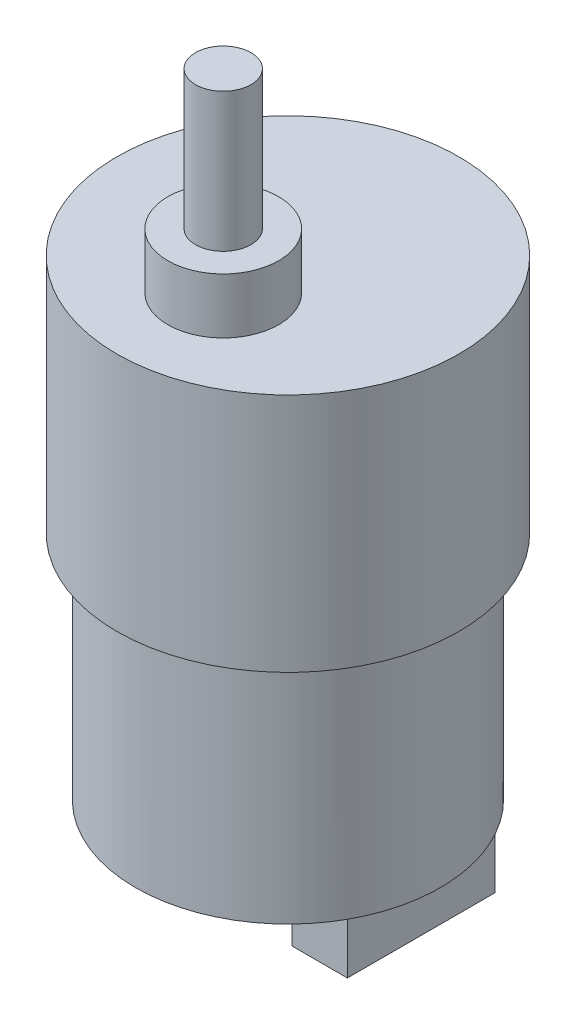
ISO-10303-21;
HEADER;
FILE_DESCRIPTION(('STEP AP214'),'2;1');
FILE_NAME('part.step','',(''),(''),'','','');
FILE_SCHEMA(('AUTOMOTIVE_DESIGN { 1 0 10303 214 1 1 1 1 }'));
ENDSEC;
DATA;
#1=APPLICATION_CONTEXT('core data for automotive mechanical design processes');
#2=APPLICATION_PROTOCOL_DEFINITION('international standard','automotive_design',2000,#1);
#3=PRODUCT_CONTEXT('',#1,'mechanical');
#4=PRODUCT('Part','Part','',(#3));
#5=PRODUCT_RELATED_PRODUCT_CATEGORY('part','',(#4));
#6=PRODUCT_DEFINITION_FORMATION('','',#4);
#7=PRODUCT_DEFINITION_CONTEXT('part definition',#1,'design');
#8=PRODUCT_DEFINITION('design','',#6,#7);
#9=PRODUCT_DEFINITION_SHAPE('','',#8);
#10=(LENGTH_UNIT() NAMED_UNIT(*) SI_UNIT(.MILLI.,.METRE.));
#11=(NAMED_UNIT(*) PLANE_ANGLE_UNIT() SI_UNIT($,.RADIAN.));
#12=(NAMED_UNIT(*) SI_UNIT($,.STERADIAN.) SOLID_ANGLE_UNIT());
#13=UNCERTAINTY_MEASURE_WITH_UNIT(LENGTH_MEASURE(1.E-05),#10,'distance_accuracy_value','');
#14=(GEOMETRIC_REPRESENTATION_CONTEXT(3) GLOBAL_UNCERTAINTY_ASSIGNED_CONTEXT((#13)) GLOBAL_UNIT_ASSIGNED_CONTEXT((#10,
#11,#12)) REPRESENTATION_CONTEXT('',''));
#15=CARTESIAN_POINT('',(0.,0.,0.));
#16=DIRECTION('',(0.,0.,1.));
#17=DIRECTION('',(1.,0.,0.));
#18=AXIS2_PLACEMENT_3D('',#15,#16,#17);
#19=CARTESIAN_POINT('',(0.,-51.,0.));
#20=DIRECTION('',(0.,1.,0.));
#21=DIRECTION('',(0.,0.,1.));
#22=AXIS2_PLACEMENT_3D('',#19,#20,#21);
#23=PLANE('',#22);
#24=CARTESIAN_POINT('',(0.,-51.,0.));
#25=DIRECTION('',(0.,1.,0.));
#26=DIRECTION('',(0.,0.,1.));
#27=AXIS2_PLACEMENT_3D('',#24,#25,#26);
#28=CIRCLE('',#27,4.5);
#29=CARTESIAN_POINT('',(0.,-51.,4.5));
#30=VERTEX_POINT('',#29);
#31=EDGE_CURVE('E194',#30,#30,#28,.T.);
#32=ORIENTED_EDGE('',*,*,#31,.T.);
#33=EDGE_LOOP('',(#32));
#34=FACE_BOUND('',#33,.T.);
#35=DIRECTION('',(1.,0.,0.));
#36=VECTOR('',#35,1.);
#37=CARTESIAN_POINT('',(0.,-51.,-8.));
#38=LINE('',#37,#36);
#39=CARTESIAN_POINT('',(8.43086968966181,-51.,-8.));
#40=VERTEX_POINT('',#39);
#41=CARTESIAN_POINT('',(14.4308696896618,-51.,-8.));
#42=VERTEX_POINT('',#41);
#43=EDGE_CURVE('E65',#40,#42,#38,.T.);
#44=ORIENTED_EDGE('',*,*,#43,.F.);
#45=DIRECTION('',(0.,0.,-1.));
#46=VECTOR('',#45,1.);
#47=CARTESIAN_POINT('',(8.43086968966181,-51.,0.));
#48=LINE('',#47,#46);
#49=CARTESIAN_POINT('',(8.43086968966181,-51.,8.));
#50=VERTEX_POINT('',#49);
#51=EDGE_CURVE('E91',#50,#40,#48,.T.);
#52=ORIENTED_EDGE('',*,*,#51,.F.);
#53=DIRECTION('',(1.,0.,0.));
#54=VECTOR('',#53,1.);
#55=CARTESIAN_POINT('',(0.,-51.,8.));
#56=LINE('',#55,#54);
#57=CARTESIAN_POINT('',(14.4308696896618,-51.,8.));
#58=VERTEX_POINT('',#57);
#59=EDGE_CURVE('E124',#50,#58,#56,.T.);
#60=ORIENTED_EDGE('',*,*,#59,.T.);
#61=CARTESIAN_POINT('',(0.,-51.,0.));
#62=DIRECTION('',(0.,1.,0.));
#63=DIRECTION('',(0.,0.,1.));
#64=AXIS2_PLACEMENT_3D('',#61,#62,#63);
#65=CIRCLE('',#64,16.5);
#66=EDGE_CURVE('E134',#42,#58,#65,.T.);
#67=ORIENTED_EDGE('',*,*,#66,.F.);
#68=EDGE_LOOP('',(#44,#52,#60,#67));
#69=FACE_BOUND('',#68,.T.);
#70=ADVANCED_FACE('F48',(#34,#69),#23,.F.);
#71=CARTESIAN_POINT('',(0.,-26.,0.));
#72=DIRECTION('',(0.,1.,0.));
#73=DIRECTION('',(0.,0.,1.));
#74=AXIS2_PLACEMENT_3D('',#71,#72,#73);
#75=CYLINDRICAL_SURFACE('',#74,18.5);
#76=CARTESIAN_POINT('',(0.,-26.,0.));
#77=DIRECTION('',(0.,1.,0.));
#78=DIRECTION('',(0.,0.,1.));
#79=AXIS2_PLACEMENT_3D('',#76,#77,#78);
#80=CIRCLE('',#79,18.5);
#81=CARTESIAN_POINT('',(0.,-26.,18.5));
#82=VERTEX_POINT('',#81);
#83=EDGE_CURVE('E57',#82,#82,#80,.T.);
#84=CARTESIAN_POINT('',(0.,0.,0.));
#85=DIRECTION('',(0.,1.,0.));
#86=DIRECTION('',(0.,0.,1.));
#87=AXIS2_PLACEMENT_3D('',#84,#85,#86);
#88=CIRCLE('',#87,18.5);
#89=CARTESIAN_POINT('',(0.,0.,18.5));
#90=VERTEX_POINT('',#89);
#91=EDGE_CURVE('E52',#90,#90,#88,.T.);
#92=CARTESIAN_POINT('',(0.,-26.,18.5));
#93=CARTESIAN_POINT('',(0.,-25.7291666666667,18.5));
#94=CARTESIAN_POINT('',(0.,-25.4583333333333,18.5));
#95=CARTESIAN_POINT('',(0.,-24.9166666666667,18.5));
#96=CARTESIAN_POINT('',(0.,-24.6458333333333,18.5));
#97=CARTESIAN_POINT('',(0.,-24.1041666666667,18.5));
#98=CARTESIAN_POINT('',(0.,-23.8333333333333,18.5));
#99=CARTESIAN_POINT('',(0.,-23.2916666666667,18.5));
#100=CARTESIAN_POINT('',(0.,-23.0208333333333,18.5));
#101=CARTESIAN_POINT('',(0.,-22.4791666666667,18.5));
#102=CARTESIAN_POINT('',(0.,-22.2083333333333,18.5));
#103=CARTESIAN_POINT('',(0.,-21.6666666666667,18.5));
#104=CARTESIAN_POINT('',(0.,-21.3958333333333,18.5));
#105=CARTESIAN_POINT('',(0.,-20.8541666666667,18.5));
#106=CARTESIAN_POINT('',(0.,-20.5833333333333,18.5));
#107=CARTESIAN_POINT('',(0.,-20.0416666666667,18.5));
#108=CARTESIAN_POINT('',(0.,-19.7708333333333,18.5));
#109=CARTESIAN_POINT('',(0.,-19.2291666666667,18.5));
#110=CARTESIAN_POINT('',(0.,-18.9583333333333,18.5));
#111=CARTESIAN_POINT('',(0.,-18.4166666666667,18.5));
#112=CARTESIAN_POINT('',(0.,-18.1458333333333,18.5));
#113=CARTESIAN_POINT('',(0.,-17.6041666666667,18.5));
#114=CARTESIAN_POINT('',(0.,-17.3333333333333,18.5));
#115=CARTESIAN_POINT('',(0.,-16.7916666666667,18.5));
#116=CARTESIAN_POINT('',(0.,-16.5208333333333,18.5));
#117=CARTESIAN_POINT('',(0.,-15.9791666666667,18.5));
#118=CARTESIAN_POINT('',(0.,-15.7083333333333,18.5));
#119=CARTESIAN_POINT('',(0.,-15.1666666666667,18.5));
#120=CARTESIAN_POINT('',(0.,-14.8958333333333,18.5));
#121=CARTESIAN_POINT('',(0.,-14.3541666666667,18.5));
#122=CARTESIAN_POINT('',(0.,-14.0833333333333,18.5));
#123=CARTESIAN_POINT('',(0.,-13.5416666666667,18.5));
#124=CARTESIAN_POINT('',(0.,-13.2708333333333,18.5));
#125=CARTESIAN_POINT('',(0.,-12.7291666666667,18.5));
#126=CARTESIAN_POINT('',(0.,-12.4583333333333,18.5));
#127=CARTESIAN_POINT('',(0.,-11.9166666666667,18.5));
#128=CARTESIAN_POINT('',(0.,-11.6458333333333,18.5));
#129=CARTESIAN_POINT('',(0.,-11.1041666666667,18.5));
#130=CARTESIAN_POINT('',(0.,-10.8333333333333,18.5));
#131=CARTESIAN_POINT('',(0.,-10.2916666666667,18.5));
#132=CARTESIAN_POINT('',(0.,-10.0208333333333,18.5));
#133=CARTESIAN_POINT('',(0.,-9.47916666666667,18.5));
#134=CARTESIAN_POINT('',(0.,-9.20833333333333,18.5));
#135=CARTESIAN_POINT('',(0.,-8.66666666666667,18.5));
#136=CARTESIAN_POINT('',(0.,-8.39583333333333,18.5));
#137=CARTESIAN_POINT('',(0.,-7.85416666666667,18.5));
#138=CARTESIAN_POINT('',(0.,-7.58333333333333,18.5));
#139=CARTESIAN_POINT('',(0.,-7.04166666666667,18.5));
#140=CARTESIAN_POINT('',(0.,-6.77083333333333,18.5));
#141=CARTESIAN_POINT('',(0.,-6.22916666666667,18.5));
#142=CARTESIAN_POINT('',(0.,-5.95833333333333,18.5));
#143=CARTESIAN_POINT('',(0.,-5.41666666666667,18.5));
#144=CARTESIAN_POINT('',(0.,-5.14583333333333,18.5));
#145=CARTESIAN_POINT('',(0.,-4.60416666666667,18.5));
#146=CARTESIAN_POINT('',(0.,-4.33333333333333,18.5));
#147=CARTESIAN_POINT('',(0.,-3.79166666666667,18.5));
#148=CARTESIAN_POINT('',(0.,-3.52083333333333,18.5));
#149=CARTESIAN_POINT('',(0.,-2.97916666666667,18.5));
#150=CARTESIAN_POINT('',(0.,-2.70833333333333,18.5));
#151=CARTESIAN_POINT('',(0.,-2.16666666666667,18.5));
#152=CARTESIAN_POINT('',(0.,-1.89583333333333,18.5));
#153=CARTESIAN_POINT('',(0.,-1.35416666666667,18.5));
#154=CARTESIAN_POINT('',(0.,-1.08333333333333,18.5));
#155=CARTESIAN_POINT('',(0.,-0.541666666666667,18.5));
#156=CARTESIAN_POINT('',(0.,-0.270833333333334,18.5));
#157=CARTESIAN_POINT('',(0.,0.,18.5));
#158=B_SPLINE_CURVE_WITH_KNOTS('',3,(#92,#93,#94,#95,#96,#97,#98,#99,#100,#101,#102,#103,#104,
#105,#106,#107,#108,#109,#110,#111,#112,#113,#114,#115,#116,#117,#118,#119,#120,#121,#122,#123,
#124,#125,#126,#127,#128,#129,#130,#131,#132,#133,#134,#135,#136,#137,#138,#139,#140,#141,#142,
#143,#144,#145,#146,#147,#148,#149,#150,#151,#152,#153,#154,#155,#156,#157),.UNSPECIFIED.,.F.,
.F.,(4,2,2,2,2,2,2,2,2,2,2,2,2,2,2,2,2,2,2,2,2,2,2,2,2,2,2,2,2,2,2,2,4),(0.,0.812499999999997,
1.625,2.4375,3.25,4.0625,4.875,5.6875,6.5,7.3125,8.125,8.9375,9.75,10.5625,11.375,12.1875,13.,
13.8125,14.625,15.4375,16.25,17.0625,17.875,18.6875,19.5,20.3125,21.125,21.9375,22.75,23.5625,
24.375,25.1875,26.),.UNSPECIFIED.);
#159=EDGE_CURVE('BSEAM50',#82,#90,#158,.T.);
#160=ORIENTED_EDGE('',*,*,#83,.T.);
#161=ORIENTED_EDGE('',*,*,#91,.F.);
#162=ORIENTED_EDGE('',*,*,#159,.T.);
#163=ORIENTED_EDGE('',*,*,#159,.F.);
#164=EDGE_LOOP('',(#160,#162,#161,#163));
#165=FACE_BOUND('',#164,.T.);
#166=ADVANCED_FACE('F50',(#165),#75,.T.);
#167=CARTESIAN_POINT('',(0.,-26.,0.));
#168=DIRECTION('',(0.,1.,0.));
#169=DIRECTION('',(0.,0.,1.));
#170=AXIS2_PLACEMENT_3D('',#167,#168,#169);
#171=PLANE('',#170);
#172=CARTESIAN_POINT('',(0.,-26.,0.));
#173=DIRECTION('',(0.,1.,0.));
#174=DIRECTION('',(0.,0.,1.));
#175=AXIS2_PLACEMENT_3D('',#172,#173,#174);
#176=CIRCLE('',#175,16.5);
#177=CARTESIAN_POINT('',(0.,-26.,16.5));
#178=VERTEX_POINT('',#177);
#179=EDGE_CURVE('E130',#178,#178,#176,.T.);
#180=ORIENTED_EDGE('',*,*,#179,.T.);
#181=EDGE_LOOP('',(#180));
#182=FACE_BOUND('',#181,.T.);
#183=ORIENTED_EDGE('',*,*,#83,.F.);
#184=EDGE_LOOP('',(#183));
#185=FACE_BOUND('',#184,.T.);
#186=ADVANCED_FACE('F145',(#182,#185),#171,.F.);
#187=CARTESIAN_POINT('',(0.,0.,0.));
#188=DIRECTION('',(0.,1.,0.));
#189=DIRECTION('',(0.,0.,1.));
#190=AXIS2_PLACEMENT_3D('',#187,#188,#189);
#191=PLANE('',#190);
#192=CARTESIAN_POINT('',(0.,0.,7.));
#193=DIRECTION('',(0.,1.,0.));
#194=DIRECTION('',(0.,0.,1.));
#195=AXIS2_PLACEMENT_3D('',#192,#193,#194);
#196=CIRCLE('',#195,6.);
#197=CARTESIAN_POINT('',(0.,0.,13.));
#198=VERTEX_POINT('',#197);
#199=EDGE_CURVE('E188',#198,#198,#196,.T.);
#200=ORIENTED_EDGE('',*,*,#199,.F.);
#201=EDGE_LOOP('',(#200));
#202=FACE_BOUND('',#201,.T.);
#203=ORIENTED_EDGE('',*,*,#91,.T.);
#204=EDGE_LOOP('',(#203));
#205=FACE_BOUND('',#204,.T.);
#206=ADVANCED_FACE('F142',(#202,#205),#191,.T.);
#207=CARTESIAN_POINT('',(0.,-51.,0.));
#208=DIRECTION('',(0.,1.,0.));
#209=DIRECTION('',(0.,0.,1.));
#210=AXIS2_PLACEMENT_3D('',#207,#208,#209);
#211=CYLINDRICAL_SURFACE('',#210,16.5);
#212=ORIENTED_EDGE('',*,*,#179,.F.);
#213=EDGE_LOOP('',(#212));
#214=FACE_BOUND('',#213,.T.);
#215=EDGE_CURVE('E131',#58,#42,#65,.T.);
#216=ORIENTED_EDGE('',*,*,#215,.T.);
#217=ORIENTED_EDGE('',*,*,#66,.T.);
#218=EDGE_LOOP('',(#216,#217));
#219=FACE_BOUND('',#218,.T.);
#220=ADVANCED_FACE('F165',(#214,#219),#211,.T.);
#221=ORIENTED_EDGE('',*,*,#215,.F.);
#222=DIRECTION('',(0.,0.,-1.));
#223=VECTOR('',#222,1.);
#224=CARTESIAN_POINT('',(14.4308696896618,-51.,0.));
#225=LINE('',#224,#223);
#226=EDGE_CURVE('E104',#58,#42,#225,.T.);
#227=ORIENTED_EDGE('',*,*,#226,.T.);
#228=EDGE_LOOP('',(#221,#227));
#229=FACE_BOUND('',#228,.T.);
#230=ADVANCED_FACE('F154',(#229),#23,.F.);
#231=CARTESIAN_POINT('',(0.,-56.5,-8.));
#232=DIRECTION('',(0.,0.,1.));
#233=DIRECTION('',(1.,0.,0.));
#234=AXIS2_PLACEMENT_3D('',#231,#232,#233);
#235=PLANE('',#234);
#236=ORIENTED_EDGE('',*,*,#43,.T.);
#237=DIRECTION('',(0.,1.,0.));
#238=VECTOR('',#237,1.);
#239=CARTESIAN_POINT('',(14.4308696896618,-56.5,-8.));
#240=LINE('',#239,#238);
#241=CARTESIAN_POINT('',(14.4308696896618,-56.5,-8.));
#242=VERTEX_POINT('',#241);
#243=EDGE_CURVE('E109',#242,#42,#240,.T.);
#244=ORIENTED_EDGE('',*,*,#243,.F.);
#245=DIRECTION('',(1.,0.,0.));
#246=VECTOR('',#245,1.);
#247=CARTESIAN_POINT('',(0.,-56.5,-8.));
#248=LINE('',#247,#246);
#249=CARTESIAN_POINT('',(8.43086968966181,-56.5,-8.));
#250=VERTEX_POINT('',#249);
#251=EDGE_CURVE('E95',#250,#242,#248,.T.);
#252=ORIENTED_EDGE('',*,*,#251,.F.);
#253=DIRECTION('',(0.,1.,0.));
#254=VECTOR('',#253,1.);
#255=CARTESIAN_POINT('',(8.43086968966181,-56.5,-8.));
#256=LINE('',#255,#254);
#257=EDGE_CURVE('E117',#250,#40,#256,.T.);
#258=ORIENTED_EDGE('',*,*,#257,.T.);
#259=EDGE_LOOP('',(#236,#244,#252,#258));
#260=FACE_BOUND('',#259,.T.);
#261=ADVANCED_FACE('F164',(#260),#235,.F.);
#262=CARTESIAN_POINT('',(14.4308696896618,-56.5,0.));
#263=DIRECTION('',(1.,0.,0.));
#264=DIRECTION('',(0.,0.,-1.));
#265=AXIS2_PLACEMENT_3D('',#262,#263,#264);
#266=PLANE('',#265);
#267=ORIENTED_EDGE('',*,*,#226,.F.);
#268=DIRECTION('',(0.,1.,0.));
#269=VECTOR('',#268,1.);
#270=CARTESIAN_POINT('',(14.4308696896618,-56.5,8.));
#271=LINE('',#270,#269);
#272=CARTESIAN_POINT('',(14.4308696896618,-56.5,8.));
#273=VERTEX_POINT('',#272);
#274=EDGE_CURVE('E100',#273,#58,#271,.T.);
#275=ORIENTED_EDGE('',*,*,#274,.F.);
#276=DIRECTION('',(0.,0.,-1.));
#277=VECTOR('',#276,1.);
#278=CARTESIAN_POINT('',(14.4308696896618,-56.5,0.));
#279=LINE('',#278,#277);
#280=EDGE_CURVE('E102',#273,#242,#279,.T.);
#281=ORIENTED_EDGE('',*,*,#280,.T.);
#282=ORIENTED_EDGE('',*,*,#243,.T.);
#283=EDGE_LOOP('',(#267,#275,#281,#282));
#284=FACE_BOUND('',#283,.T.);
#285=ADVANCED_FACE('F101',(#284),#266,.T.);
#286=CARTESIAN_POINT('',(0.,-56.5,8.));
#287=DIRECTION('',(0.,0.,1.));
#288=DIRECTION('',(1.,0.,0.));
#289=AXIS2_PLACEMENT_3D('',#286,#287,#288);
#290=PLANE('',#289);
#291=ORIENTED_EDGE('',*,*,#59,.F.);
#292=DIRECTION('',(0.,1.,0.));
#293=VECTOR('',#292,1.);
#294=CARTESIAN_POINT('',(8.43086968966181,-56.5,8.));
#295=LINE('',#294,#293);
#296=CARTESIAN_POINT('',(8.43086968966181,-56.5,8.));
#297=VERTEX_POINT('',#296);
#298=EDGE_CURVE('E110',#297,#50,#295,.T.);
#299=ORIENTED_EDGE('',*,*,#298,.F.);
#300=DIRECTION('',(1.,0.,0.));
#301=VECTOR('',#300,1.);
#302=CARTESIAN_POINT('',(0.,-56.5,8.));
#303=LINE('',#302,#301);
#304=EDGE_CURVE('E113',#297,#273,#303,.T.);
#305=ORIENTED_EDGE('',*,*,#304,.T.);
#306=ORIENTED_EDGE('',*,*,#274,.T.);
#307=EDGE_LOOP('',(#291,#299,#305,#306));
#308=FACE_BOUND('',#307,.T.);
#309=ADVANCED_FACE('F115',(#308),#290,.T.);
#310=CARTESIAN_POINT('',(8.43086968966181,-56.5,0.));
#311=DIRECTION('',(1.,0.,0.));
#312=DIRECTION('',(0.,0.,-1.));
#313=AXIS2_PLACEMENT_3D('',#310,#311,#312);
#314=PLANE('',#313);
#315=ORIENTED_EDGE('',*,*,#51,.T.);
#316=ORIENTED_EDGE('',*,*,#257,.F.);
#317=DIRECTION('',(0.,0.,-1.));
#318=VECTOR('',#317,1.);
#319=CARTESIAN_POINT('',(8.43086968966181,-56.5,0.));
#320=LINE('',#319,#318);
#321=EDGE_CURVE('E74',#297,#250,#320,.T.);
#322=ORIENTED_EDGE('',*,*,#321,.F.);
#323=ORIENTED_EDGE('',*,*,#298,.T.);
#324=EDGE_LOOP('',(#315,#316,#322,#323));
#325=FACE_BOUND('',#324,.T.);
#326=ADVANCED_FACE('F212',(#325),#314,.F.);
#327=CARTESIAN_POINT('',(0.,-56.5,0.));
#328=DIRECTION('',(0.,1.,0.));
#329=DIRECTION('',(0.,0.,1.));
#330=AXIS2_PLACEMENT_3D('',#327,#328,#329);
#331=PLANE('',#330);
#332=ORIENTED_EDGE('',*,*,#251,.T.);
#333=ORIENTED_EDGE('',*,*,#280,.F.);
#334=ORIENTED_EDGE('',*,*,#304,.F.);
#335=ORIENTED_EDGE('',*,*,#321,.T.);
#336=EDGE_LOOP('',(#332,#333,#334,#335));
#337=FACE_BOUND('',#336,.T.);
#338=ADVANCED_FACE('F112',(#337),#331,.F.);
#339=CARTESIAN_POINT('',(0.,-59.5,0.));
#340=DIRECTION('',(0.,1.,0.));
#341=DIRECTION('',(0.,0.,1.));
#342=AXIS2_PLACEMENT_3D('',#339,#340,#341);
#343=CYLINDRICAL_SURFACE('',#342,4.5);
#344=CARTESIAN_POINT('',(0.,-59.5,0.));
#345=DIRECTION('',(0.,1.,0.));
#346=DIRECTION('',(0.,0.,1.));
#347=AXIS2_PLACEMENT_3D('',#344,#345,#346);
#348=CIRCLE('',#347,4.5);
#349=CARTESIAN_POINT('',(0.,-59.5,4.5));
#350=VERTEX_POINT('',#349);
#351=EDGE_CURVE('E122',#350,#350,#348,.T.);
#352=ORIENTED_EDGE('',*,*,#351,.T.);
#353=EDGE_LOOP('',(#352));
#354=FACE_BOUND('',#353,.T.);
#355=ORIENTED_EDGE('',*,*,#31,.F.);
#356=EDGE_LOOP('',(#355));
#357=FACE_BOUND('',#356,.T.);
#358=ADVANCED_FACE('F203',(#354,#357),#343,.T.);
#359=CARTESIAN_POINT('',(0.,-59.5,0.));
#360=DIRECTION('',(0.,1.,0.));
#361=DIRECTION('',(0.,0.,1.));
#362=AXIS2_PLACEMENT_3D('',#359,#360,#361);
#363=PLANE('',#362);
#364=ORIENTED_EDGE('',*,*,#351,.F.);
#365=EDGE_LOOP('',(#364));
#366=FACE_BOUND('',#365,.T.);
#367=ADVANCED_FACE('F204',(#366),#363,.F.);
#368=CARTESIAN_POINT('',(0.,6.,7.));
#369=DIRECTION('',(0.,-1.,0.));
#370=DIRECTION('',(0.,0.,-1.));
#371=AXIS2_PLACEMENT_3D('',#368,#369,#370);
#372=CYLINDRICAL_SURFACE('',#371,6.);
#373=CARTESIAN_POINT('',(0.,6.,7.));
#374=DIRECTION('',(0.,1.,0.));
#375=DIRECTION('',(0.,0.,1.));
#376=AXIS2_PLACEMENT_3D('',#373,#374,#375);
#377=CIRCLE('',#376,6.);
#378=CARTESIAN_POINT('',(0.,6.,13.));
#379=VERTEX_POINT('',#378);
#380=EDGE_CURVE('E190',#379,#379,#377,.T.);
#381=ORIENTED_EDGE('',*,*,#380,.F.);
#382=EDGE_LOOP('',(#381));
#383=FACE_BOUND('',#382,.T.);
#384=ORIENTED_EDGE('',*,*,#199,.T.);
#385=EDGE_LOOP('',(#384));
#386=FACE_BOUND('',#385,.T.);
#387=ADVANCED_FACE('F209',(#383,#386),#372,.T.);
#388=CARTESIAN_POINT('',(0.,6.,0.));
#389=DIRECTION('',(0.,1.,0.));
#390=DIRECTION('',(0.,0.,1.));
#391=AXIS2_PLACEMENT_3D('',#388,#389,#390);
#392=PLANE('',#391);
#393=CARTESIAN_POINT('',(0.,6.,7.));
#394=DIRECTION('',(0.,1.,0.));
#395=DIRECTION('',(0.,0.,1.));
#396=AXIS2_PLACEMENT_3D('',#393,#394,#395);
#397=CIRCLE('',#396,3.);
#398=CARTESIAN_POINT('',(0.,6.,10.));
#399=VERTEX_POINT('',#398);
#400=EDGE_CURVE('E12',#399,#399,#397,.T.);
#401=ORIENTED_EDGE('',*,*,#400,.F.);
#402=EDGE_LOOP('',(#401));
#403=FACE_BOUND('',#402,.T.);
#404=ORIENTED_EDGE('',*,*,#380,.T.);
#405=EDGE_LOOP('',(#404));
#406=FACE_BOUND('',#405,.T.);
#407=ADVANCED_FACE('F265',(#403,#406),#392,.T.);
#408=CARTESIAN_POINT('',(0.,21.,7.));
#409=DIRECTION('',(0.,-1.,0.));
#410=DIRECTION('',(0.,0.,-1.));
#411=AXIS2_PLACEMENT_3D('',#408,#409,#410);
#412=CYLINDRICAL_SURFACE('',#411,3.);
#413=CARTESIAN_POINT('',(0.,21.,7.));
#414=DIRECTION('',(0.,1.,0.));
#415=DIRECTION('',(0.,0.,1.));
#416=AXIS2_PLACEMENT_3D('',#413,#414,#415);
#417=CIRCLE('',#416,3.);
#418=CARTESIAN_POINT('',(0.,21.,10.));
#419=VERTEX_POINT('',#418);
#420=EDGE_CURVE('E191',#419,#419,#417,.T.);
#421=ORIENTED_EDGE('',*,*,#420,.F.);
#422=EDGE_LOOP('',(#421));
#423=FACE_BOUND('',#422,.T.);
#424=ORIENTED_EDGE('',*,*,#400,.T.);
#425=EDGE_LOOP('',(#424));
#426=FACE_BOUND('',#425,.T.);
#427=ADVANCED_FACE('F274',(#423,#426),#412,.T.);
#428=CARTESIAN_POINT('',(0.,21.,7.));
#429=DIRECTION('',(0.,1.,0.));
#430=DIRECTION('',(0.,0.,1.));
#431=AXIS2_PLACEMENT_3D('',#428,#429,#430);
#432=PLANE('',#431);
#433=ORIENTED_EDGE('',*,*,#420,.T.);
#434=EDGE_LOOP('',(#433));
#435=FACE_BOUND('',#434,.T.);
#436=ADVANCED_FACE('F287',(#435),#432,.T.);
#437=CLOSED_SHELL('',(#70,#166,#186,#206,#220,#230,#261,#285,#309,#326,#338,#358,#367,#387,#407,
#427,#436));
#438=MANIFOLD_SOLID_BREP('B2',#437);
#439=ADVANCED_BREP_SHAPE_REPRESENTATION('',(#18,#438),#14);
#440=SHAPE_DEFINITION_REPRESENTATION(#9,#439);
ENDSEC;
END-ISO-10303-21;
